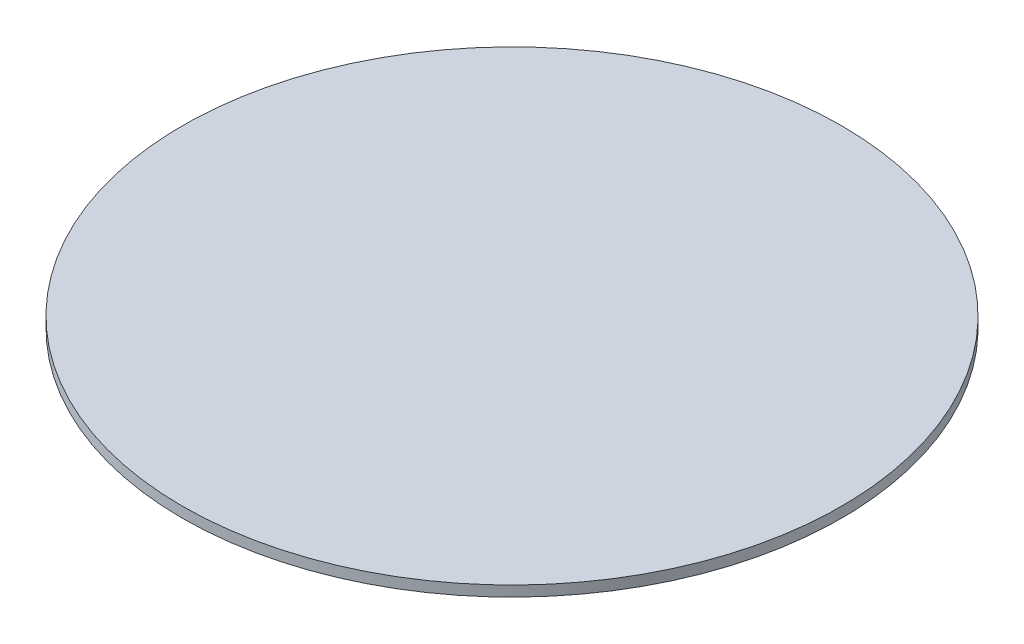
ISO-10303-21;
HEADER;
FILE_DESCRIPTION(('STEP AP214'),'2;1');
FILE_NAME('part.step','',(''),(''),'','','');
FILE_SCHEMA(('AUTOMOTIVE_DESIGN { 1 0 10303 214 1 1 1 1 }'));
ENDSEC;
DATA;
#1=APPLICATION_CONTEXT('core data for automotive mechanical design processes');
#2=APPLICATION_PROTOCOL_DEFINITION('international standard','automotive_design',2000,#1);
#3=PRODUCT_CONTEXT('',#1,'mechanical');
#4=PRODUCT('Part','Part','',(#3));
#5=PRODUCT_RELATED_PRODUCT_CATEGORY('part','',(#4));
#6=PRODUCT_DEFINITION_FORMATION('','',#4);
#7=PRODUCT_DEFINITION_CONTEXT('part definition',#1,'design');
#8=PRODUCT_DEFINITION('design','',#6,#7);
#9=PRODUCT_DEFINITION_SHAPE('','',#8);
#10=(LENGTH_UNIT() NAMED_UNIT(*) SI_UNIT(.MILLI.,.METRE.));
#11=(NAMED_UNIT(*) PLANE_ANGLE_UNIT() SI_UNIT($,.RADIAN.));
#12=(NAMED_UNIT(*) SI_UNIT($,.STERADIAN.) SOLID_ANGLE_UNIT());
#13=UNCERTAINTY_MEASURE_WITH_UNIT(LENGTH_MEASURE(1.E-05),#10,'distance_accuracy_value','');
#14=(GEOMETRIC_REPRESENTATION_CONTEXT(3) GLOBAL_UNCERTAINTY_ASSIGNED_CONTEXT((#13)) GLOBAL_UNIT_ASSIGNED_CONTEXT((#10,
#11,#12)) REPRESENTATION_CONTEXT('',''));
#15=CARTESIAN_POINT('',(0.,0.,0.));
#16=DIRECTION('',(0.,0.,1.));
#17=DIRECTION('',(1.,0.,0.));
#18=AXIS2_PLACEMENT_3D('',#15,#16,#17);
#19=CARTESIAN_POINT('',(0.,38.1,0.));
#20=DIRECTION('',(0.,-1.,0.));
#21=DIRECTION('',(0.,0.,-1.));
#22=AXIS2_PLACEMENT_3D('',#19,#20,#21);
#23=CYLINDRICAL_SURFACE('',#22,1200.);
#24=CARTESIAN_POINT('',(0.,38.1,0.));
#25=DIRECTION('',(0.,1.,0.));
#26=DIRECTION('',(0.,0.,1.));
#27=AXIS2_PLACEMENT_3D('',#24,#25,#26);
#28=CIRCLE('',#27,1200.);
#29=CARTESIAN_POINT('',(0.,38.1,1200.));
#30=VERTEX_POINT('',#29);
#31=EDGE_CURVE('E10',#30,#30,#28,.T.);
#32=ORIENTED_EDGE('',*,*,#31,.F.);
#33=EDGE_LOOP('',(#32));
#34=FACE_BOUND('',#33,.T.);
#35=CARTESIAN_POINT('',(0.,0.,0.));
#36=DIRECTION('',(0.,1.,0.));
#37=DIRECTION('',(0.,0.,1.));
#38=AXIS2_PLACEMENT_3D('',#35,#36,#37);
#39=CIRCLE('',#38,1200.);
#40=CARTESIAN_POINT('',(0.,0.,1200.));
#41=VERTEX_POINT('',#40);
#42=EDGE_CURVE('E40',#41,#41,#39,.T.);
#43=ORIENTED_EDGE('',*,*,#42,.T.);
#44=EDGE_LOOP('',(#43));
#45=FACE_BOUND('',#44,.T.);
#46=ADVANCED_FACE('F37',(#34,#45),#23,.T.);
#47=CARTESIAN_POINT('',(0.,38.1,0.));
#48=DIRECTION('',(0.,1.,0.));
#49=DIRECTION('',(0.,0.,1.));
#50=AXIS2_PLACEMENT_3D('',#47,#48,#49);
#51=PLANE('',#50);
#52=ORIENTED_EDGE('',*,*,#31,.T.);
#53=EDGE_LOOP('',(#52));
#54=FACE_BOUND('',#53,.T.);
#55=ADVANCED_FACE('F52',(#54),#51,.T.);
#56=CARTESIAN_POINT('',(0.,0.,0.));
#57=DIRECTION('',(0.,1.,0.));
#58=DIRECTION('',(0.,0.,1.));
#59=AXIS2_PLACEMENT_3D('',#56,#57,#58);
#60=PLANE('',#59);
#61=ORIENTED_EDGE('',*,*,#42,.F.);
#62=EDGE_LOOP('',(#61));
#63=FACE_BOUND('',#62,.T.);
#64=ADVANCED_FACE('F50',(#63),#60,.F.);
#65=CLOSED_SHELL('',(#46,#55,#64));
#66=MANIFOLD_SOLID_BREP('B2',#65);
#67=ADVANCED_BREP_SHAPE_REPRESENTATION('',(#18,#66),#14);
#68=SHAPE_DEFINITION_REPRESENTATION(#9,#67);
ENDSEC;
END-ISO-10303-21;
